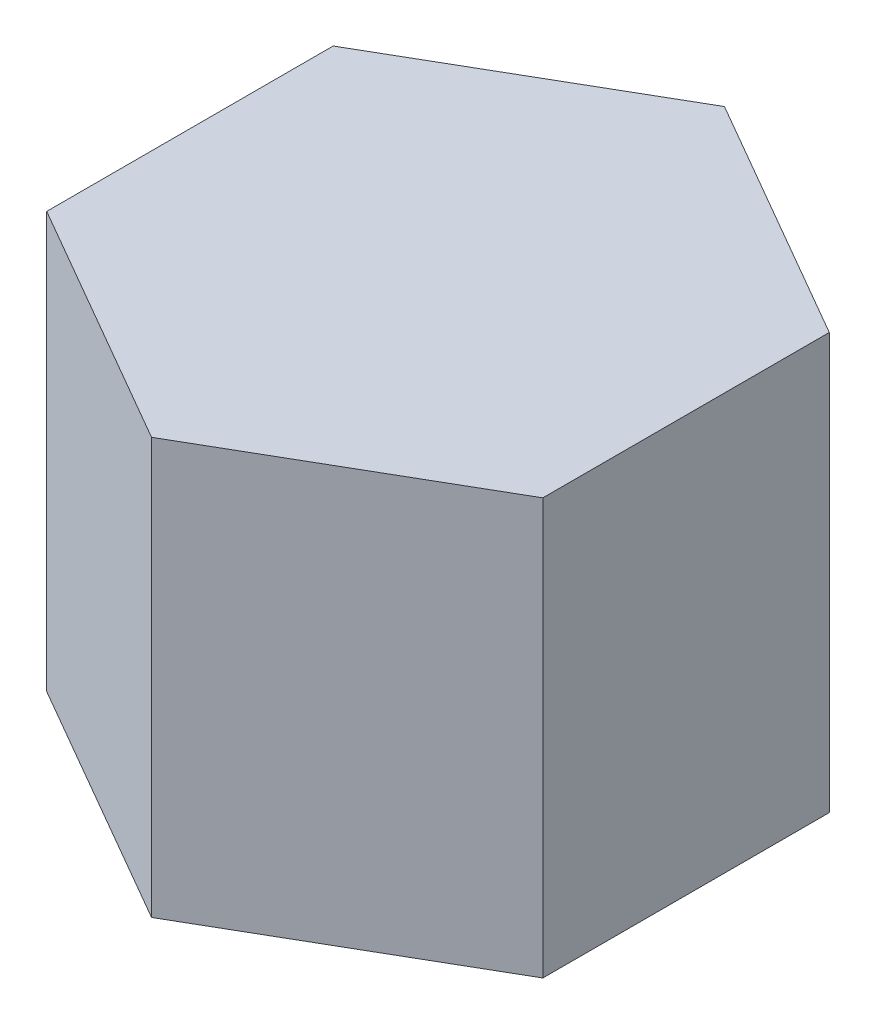
ISO-10303-21;
HEADER;
FILE_DESCRIPTION(('STEP AP214'),'2;1');
FILE_NAME('part.step','',(''),(''),'','','');
FILE_SCHEMA(('AUTOMOTIVE_DESIGN { 1 0 10303 214 1 1 1 1 }'));
ENDSEC;
DATA;
#1=APPLICATION_CONTEXT('core data for automotive mechanical design processes');
#2=APPLICATION_PROTOCOL_DEFINITION('international standard','automotive_design',2000,#1);
#3=PRODUCT_CONTEXT('',#1,'mechanical');
#4=PRODUCT('Part','Part','',(#3));
#5=PRODUCT_RELATED_PRODUCT_CATEGORY('part','',(#4));
#6=PRODUCT_DEFINITION_FORMATION('','',#4);
#7=PRODUCT_DEFINITION_CONTEXT('part definition',#1,'design');
#8=PRODUCT_DEFINITION('design','',#6,#7);
#9=PRODUCT_DEFINITION_SHAPE('','',#8);
#10=(LENGTH_UNIT() NAMED_UNIT(*) SI_UNIT(.MILLI.,.METRE.));
#11=(NAMED_UNIT(*) PLANE_ANGLE_UNIT() SI_UNIT($,.RADIAN.));
#12=(NAMED_UNIT(*) SI_UNIT($,.STERADIAN.) SOLID_ANGLE_UNIT());
#13=UNCERTAINTY_MEASURE_WITH_UNIT(LENGTH_MEASURE(1.E-05),#10,'distance_accuracy_value','');
#14=(GEOMETRIC_REPRESENTATION_CONTEXT(3) GLOBAL_UNCERTAINTY_ASSIGNED_CONTEXT((#13)) GLOBAL_UNIT_ASSIGNED_CONTEXT((#10,
#11,#12)) REPRESENTATION_CONTEXT('',''));
#15=CARTESIAN_POINT('',(0.,0.,0.));
#16=DIRECTION('',(0.,0.,1.));
#17=DIRECTION('',(1.,0.,0.));
#18=AXIS2_PLACEMENT_3D('',#15,#16,#17);
#19=CARTESIAN_POINT('',(207.142660308706,-148.537700895744,288.908895009141));
#20=DIRECTION('',(-0.499999999999943,0.,-0.866025403784472));
#21=DIRECTION('',(-0.866025403784472,0.,0.499999999999943));
#22=AXIS2_PLACEMENT_3D('',#19,#20,#21);
#23=PLANE('',#22);
#24=CARTESIAN_POINT('',(206.839551417382,-149.045793579175,289.083895009141));
#25=DIRECTION('',(0.866025403784471,0.,-0.499999999999943));
#26=VECTOR('',#25,1.);
#27=LINE('',#24,#26);
#28=CARTESIAN_POINT('',(206.839551417382,-149.045793579175,289.083895009141));
#29=VERTEX_POINT('',#28);
#30=CARTESIAN_POINT('',(207.142660308706,-149.045793579175,288.908895009141));
#31=VERTEX_POINT('',#30);
#32=EDGE_CURVE('E170',#29,#31,#27,.T.);
#33=ORIENTED_EDGE('',*,*,#32,.T.);
#34=CARTESIAN_POINT('',(207.142660308706,-148.537700895744,288.908895009141));
#35=DIRECTION('',(0.,-1.,0.));
#36=VECTOR('',#35,1.);
#37=LINE('',#34,#36);
#38=CARTESIAN_POINT('',(207.142660308706,-148.537700895744,288.908895009141));
#39=VERTEX_POINT('',#38);
#40=EDGE_CURVE('E35',#39,#31,#37,.T.);
#41=ORIENTED_EDGE('',*,*,#40,.F.);
#42=CARTESIAN_POINT('',(206.839551417382,-148.537700895744,289.083895009141));
#43=DIRECTION('',(0.866025403784471,0.,-0.499999999999943));
#44=VECTOR('',#43,1.);
#45=LINE('',#42,#44);
#46=CARTESIAN_POINT('',(206.839551417382,-148.537700895744,289.083895009141));
#47=VERTEX_POINT('',#46);
#48=EDGE_CURVE('E159',#47,#39,#45,.T.);
#49=ORIENTED_EDGE('',*,*,#48,.F.);
#50=CARTESIAN_POINT('',(206.839551417382,-148.537700895744,289.083895009141));
#51=DIRECTION('',(0.,-1.,0.));
#52=VECTOR('',#51,1.);
#53=LINE('',#50,#52);
#54=EDGE_CURVE('E10',#47,#29,#53,.T.);
#55=ORIENTED_EDGE('',*,*,#54,.T.);
#56=EDGE_LOOP('',(#33,#41,#49,#55));
#57=FACE_BOUND('',#56,.T.);
#58=ADVANCED_FACE('F16',(#57),#23,.F.);
#59=CARTESIAN_POINT('',(206.839551417382,-148.537700895744,289.083895009141));
#60=DIRECTION('',(0.499999999999978,0.,-0.866025403784452));
#61=DIRECTION('',(-0.866025403784452,0.,-0.499999999999978));
#62=AXIS2_PLACEMENT_3D('',#59,#60,#61);
#63=PLANE('',#62);
#64=CARTESIAN_POINT('',(206.536442526057,-149.045793579175,288.908895009141));
#65=DIRECTION('',(0.866025403784452,0.,0.499999999999978));
#66=VECTOR('',#65,1.);
#67=LINE('',#64,#66);
#68=CARTESIAN_POINT('',(206.536442526057,-149.045793579175,288.908895009141));
#69=VERTEX_POINT('',#68);
#70=EDGE_CURVE('E167',#69,#29,#67,.T.);
#71=ORIENTED_EDGE('',*,*,#70,.T.);
#72=ORIENTED_EDGE('',*,*,#54,.F.);
#73=CARTESIAN_POINT('',(206.536442526057,-148.537700895744,288.908895009141));
#74=DIRECTION('',(0.866025403784452,0.,0.499999999999978));
#75=VECTOR('',#74,1.);
#76=LINE('',#73,#75);
#77=CARTESIAN_POINT('',(206.536442526057,-148.537700895744,288.908895009141));
#78=VERTEX_POINT('',#77);
#79=EDGE_CURVE('E156',#78,#47,#76,.T.);
#80=ORIENTED_EDGE('',*,*,#79,.F.);
#81=CARTESIAN_POINT('',(206.536442526057,-148.537700895744,288.908895009141));
#82=DIRECTION('',(0.,-1.,0.));
#83=VECTOR('',#82,1.);
#84=LINE('',#81,#83);
#85=EDGE_CURVE('E27',#78,#69,#84,.T.);
#86=ORIENTED_EDGE('',*,*,#85,.T.);
#87=EDGE_LOOP('',(#71,#72,#80,#86));
#88=FACE_BOUND('',#87,.T.);
#89=ADVANCED_FACE('F189',(#88),#63,.F.);
#90=CARTESIAN_POINT('',(206.536442526057,-148.537700895744,290.831971220494));
#91=DIRECTION('',(1.,0.,0.));
#92=DIRECTION('',(0.,1.,0.));
#93=AXIS2_PLACEMENT_3D('',#90,#91,#92);
#94=PLANE('',#93);
#95=CARTESIAN_POINT('',(206.536442526057,-149.045793579175,288.558895009141));
#96=DIRECTION('',(0.,0.,1.));
#97=VECTOR('',#96,1.);
#98=LINE('',#95,#97);
#99=CARTESIAN_POINT('',(206.536442526057,-149.045793579175,288.558895009141));
#100=VERTEX_POINT('',#99);
#101=EDGE_CURVE('E163',#100,#69,#98,.T.);
#102=ORIENTED_EDGE('',*,*,#101,.T.);
#103=ORIENTED_EDGE('',*,*,#85,.F.);
#104=CARTESIAN_POINT('',(206.536442526057,-148.537700895744,288.558895009141));
#105=DIRECTION('',(0.,0.,1.));
#106=VECTOR('',#105,1.);
#107=LINE('',#104,#106);
#108=CARTESIAN_POINT('',(206.536442526057,-148.537700895744,288.558895009141));
#109=VERTEX_POINT('',#108);
#110=EDGE_CURVE('E106',#109,#78,#107,.T.);
#111=ORIENTED_EDGE('',*,*,#110,.F.);
#112=CARTESIAN_POINT('',(206.536442526057,-148.537700895744,288.558895009141));
#113=DIRECTION('',(0.,-1.,0.));
#114=VECTOR('',#113,1.);
#115=LINE('',#112,#114);
#116=EDGE_CURVE('E94',#109,#100,#115,.T.);
#117=ORIENTED_EDGE('',*,*,#116,.T.);
#118=EDGE_LOOP('',(#102,#103,#111,#117));
#119=FACE_BOUND('',#118,.T.);
#120=ADVANCED_FACE('F198',(#119),#94,.F.);
#121=CARTESIAN_POINT('',(206.536442526057,-148.537700895744,288.558895009141));
#122=DIRECTION('',(0.499999999999978,0.,0.866025403784452));
#123=DIRECTION('',(0.866025403784452,0.,-0.499999999999978));
#124=AXIS2_PLACEMENT_3D('',#121,#122,#123);
#125=PLANE('',#124);
#126=CARTESIAN_POINT('',(206.839551417382,-149.045793579175,288.383895009141));
#127=DIRECTION('',(-0.866025403784452,0.,0.499999999999978));
#128=VECTOR('',#127,1.);
#129=LINE('',#126,#128);
#130=CARTESIAN_POINT('',(206.839551417382,-149.045793579175,288.383895009141));
#131=VERTEX_POINT('',#130);
#132=EDGE_CURVE('E162',#131,#100,#129,.T.);
#133=ORIENTED_EDGE('',*,*,#132,.T.);
#134=ORIENTED_EDGE('',*,*,#116,.F.);
#135=CARTESIAN_POINT('',(206.839551417382,-148.537700895744,288.383895009141));
#136=DIRECTION('',(-0.866025403784452,0.,0.499999999999978));
#137=VECTOR('',#136,1.);
#138=LINE('',#135,#137);
#139=CARTESIAN_POINT('',(206.839551417382,-148.537700895744,288.383895009141));
#140=VERTEX_POINT('',#139);
#141=EDGE_CURVE('E98',#140,#109,#138,.T.);
#142=ORIENTED_EDGE('',*,*,#141,.F.);
#143=CARTESIAN_POINT('',(206.839551417382,-148.537700895744,288.383895009141));
#144=DIRECTION('',(0.,-1.,0.));
#145=VECTOR('',#144,1.);
#146=LINE('',#143,#145);
#147=EDGE_CURVE('E79',#140,#131,#146,.T.);
#148=ORIENTED_EDGE('',*,*,#147,.T.);
#149=EDGE_LOOP('',(#133,#134,#142,#148));
#150=FACE_BOUND('',#149,.T.);
#151=ADVANCED_FACE('F100',(#150),#125,.F.);
#152=CARTESIAN_POINT('',(206.839551417382,-148.537700895744,288.383895009141));
#153=DIRECTION('',(-0.499999999999943,0.,0.866025403784472));
#154=DIRECTION('',(0.866025403784472,0.,0.499999999999943));
#155=AXIS2_PLACEMENT_3D('',#152,#153,#154);
#156=PLANE('',#155);
#157=CARTESIAN_POINT('',(207.142660308706,-149.045793579175,288.558895009141));
#158=DIRECTION('',(-0.866025403784471,0.,-0.499999999999943));
#159=VECTOR('',#158,1.);
#160=LINE('',#157,#159);
#161=CARTESIAN_POINT('',(207.142660308706,-149.045793579175,288.558895009141));
#162=VERTEX_POINT('',#161);
#163=EDGE_CURVE('E88',#162,#131,#160,.T.);
#164=ORIENTED_EDGE('',*,*,#163,.T.);
#165=ORIENTED_EDGE('',*,*,#147,.F.);
#166=CARTESIAN_POINT('',(207.142660308706,-148.537700895744,288.558895009141));
#167=DIRECTION('',(-0.866025403784471,0.,-0.499999999999943));
#168=VECTOR('',#167,1.);
#169=LINE('',#166,#168);
#170=CARTESIAN_POINT('',(207.142660308706,-148.537700895744,288.558895009141));
#171=VERTEX_POINT('',#170);
#172=EDGE_CURVE('E84',#171,#140,#169,.T.);
#173=ORIENTED_EDGE('',*,*,#172,.F.);
#174=CARTESIAN_POINT('',(207.142660308706,-148.537700895744,288.558895009141));
#175=DIRECTION('',(0.,-1.,0.));
#176=VECTOR('',#175,1.);
#177=LINE('',#174,#176);
#178=EDGE_CURVE('E58',#171,#162,#177,.T.);
#179=ORIENTED_EDGE('',*,*,#178,.T.);
#180=EDGE_LOOP('',(#164,#165,#173,#179));
#181=FACE_BOUND('',#180,.T.);
#182=ADVANCED_FACE('F82',(#181),#156,.F.);
#183=CARTESIAN_POINT('',(207.142660308706,-148.537700895744,290.831971220494));
#184=DIRECTION('',(-1.,0.,0.));
#185=DIRECTION('',(0.,-1.,0.));
#186=AXIS2_PLACEMENT_3D('',#183,#184,#185);
#187=PLANE('',#186);
#188=CARTESIAN_POINT('',(207.142660308706,-149.045793579175,288.908895009141));
#189=DIRECTION('',(0.,0.,-1.));
#190=VECTOR('',#189,1.);
#191=LINE('',#188,#190);
#192=EDGE_CURVE('E160',#31,#162,#191,.T.);
#193=ORIENTED_EDGE('',*,*,#192,.T.);
#194=ORIENTED_EDGE('',*,*,#178,.F.);
#195=CARTESIAN_POINT('',(207.142660308706,-148.537700895744,288.908895009141));
#196=DIRECTION('',(0.,0.,-1.));
#197=VECTOR('',#196,1.);
#198=LINE('',#195,#197);
#199=EDGE_CURVE('E112',#39,#171,#198,.T.);
#200=ORIENTED_EDGE('',*,*,#199,.F.);
#201=ORIENTED_EDGE('',*,*,#40,.T.);
#202=EDGE_LOOP('',(#193,#194,#200,#201));
#203=FACE_BOUND('',#202,.T.);
#204=ADVANCED_FACE('F131',(#203),#187,.F.);
#205=CARTESIAN_POINT('',(206.339551417382,-148.537700895744,290.831971220494));
#206=DIRECTION('',(0.,-1.,0.));
#207=DIRECTION('',(1.,0.,0.));
#208=AXIS2_PLACEMENT_3D('',#205,#206,#207);
#209=PLANE('',#208);
#210=ORIENTED_EDGE('',*,*,#48,.T.);
#211=ORIENTED_EDGE('',*,*,#199,.T.);
#212=ORIENTED_EDGE('',*,*,#172,.T.);
#213=ORIENTED_EDGE('',*,*,#141,.T.);
#214=ORIENTED_EDGE('',*,*,#110,.T.);
#215=ORIENTED_EDGE('',*,*,#79,.T.);
#216=EDGE_LOOP('',(#210,#211,#212,#213,#214,#215));
#217=FACE_BOUND('',#216,.T.);
#218=ADVANCED_FACE('F111',(#217),#209,.F.);
#219=CARTESIAN_POINT('',(206.339551417382,-149.045793579175,290.831971220494));
#220=DIRECTION('',(0.,-1.,0.));
#221=DIRECTION('',(1.,0.,0.));
#222=AXIS2_PLACEMENT_3D('',#219,#220,#221);
#223=PLANE('',#222);
#224=ORIENTED_EDGE('',*,*,#32,.F.);
#225=ORIENTED_EDGE('',*,*,#70,.F.);
#226=ORIENTED_EDGE('',*,*,#101,.F.);
#227=ORIENTED_EDGE('',*,*,#132,.F.);
#228=ORIENTED_EDGE('',*,*,#163,.F.);
#229=ORIENTED_EDGE('',*,*,#192,.F.);
#230=EDGE_LOOP('',(#224,#225,#226,#227,#228,#229));
#231=FACE_BOUND('',#230,.T.);
#232=ADVANCED_FACE('F130',(#231),#223,.T.);
#233=CLOSED_SHELL('',(#58,#89,#120,#151,#182,#204,#218,#232));
#234=MANIFOLD_SOLID_BREP('B1',#233);
#235=ADVANCED_BREP_SHAPE_REPRESENTATION('',(#18,#234),#14);
#236=SHAPE_DEFINITION_REPRESENTATION(#9,#235);
ENDSEC;
END-ISO-10303-21;
